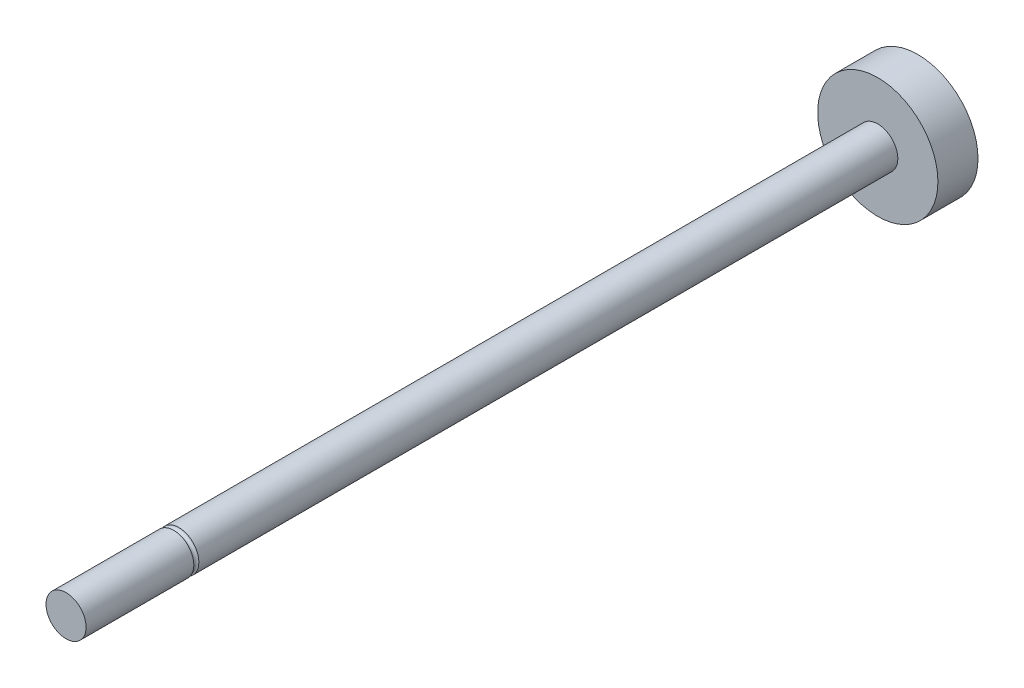
ISO-10303-21;
HEADER;
FILE_DESCRIPTION(('STEP AP214'),'2;1');
FILE_NAME('part.step','',(''),(''),'','','');
FILE_SCHEMA(('AUTOMOTIVE_DESIGN { 1 0 10303 214 1 1 1 1 }'));
ENDSEC;
DATA;
#1=APPLICATION_CONTEXT('core data for automotive mechanical design processes');
#2=APPLICATION_PROTOCOL_DEFINITION('international standard','automotive_design',2000,#1);
#3=PRODUCT_CONTEXT('',#1,'mechanical');
#4=PRODUCT('Part','Part','',(#3));
#5=PRODUCT_RELATED_PRODUCT_CATEGORY('part','',(#4));
#6=PRODUCT_DEFINITION_FORMATION('','',#4);
#7=PRODUCT_DEFINITION_CONTEXT('part definition',#1,'design');
#8=PRODUCT_DEFINITION('design','',#6,#7);
#9=PRODUCT_DEFINITION_SHAPE('','',#8);
#10=(LENGTH_UNIT() NAMED_UNIT(*) SI_UNIT(.MILLI.,.METRE.));
#11=(NAMED_UNIT(*) PLANE_ANGLE_UNIT() SI_UNIT($,.RADIAN.));
#12=(NAMED_UNIT(*) SI_UNIT($,.STERADIAN.) SOLID_ANGLE_UNIT());
#13=UNCERTAINTY_MEASURE_WITH_UNIT(LENGTH_MEASURE(1.E-05),#10,'distance_accuracy_value','');
#14=(GEOMETRIC_REPRESENTATION_CONTEXT(3) GLOBAL_UNCERTAINTY_ASSIGNED_CONTEXT((#13)) GLOBAL_UNIT_ASSIGNED_CONTEXT((#10,
#11,#12)) REPRESENTATION_CONTEXT('',''));
#15=CARTESIAN_POINT('',(0.,0.,0.));
#16=DIRECTION('',(0.,0.,1.));
#17=DIRECTION('',(1.,0.,0.));
#18=AXIS2_PLACEMENT_3D('',#15,#16,#17);
#19=CARTESIAN_POINT('',(0.,0.,85.));
#20=DIRECTION('',(0.,0.,-1.));
#21=DIRECTION('',(-1.,0.,0.));
#22=AXIS2_PLACEMENT_3D('',#19,#20,#21);
#23=CYLINDRICAL_SURFACE('',#22,2.);
#24=CARTESIAN_POINT('',(0.,0.,73.75));
#25=DIRECTION('',(0.,0.,1.));
#26=DIRECTION('',(1.,0.,0.));
#27=AXIS2_PLACEMENT_3D('',#24,#25,#26);
#28=CIRCLE('',#27,2.);
#29=CARTESIAN_POINT('',(2.,0.,73.75));
#30=VERTEX_POINT('',#29);
#31=EDGE_CURVE('E39',#30,#30,#28,.F.);
#32=ORIENTED_EDGE('',*,*,#31,.T.);
#33=EDGE_LOOP('',(#32));
#34=FACE_BOUND('',#33,.T.);
#35=CARTESIAN_POINT('',(0.,0.,4.));
#36=DIRECTION('',(0.,0.,1.));
#37=DIRECTION('',(1.,0.,0.));
#38=AXIS2_PLACEMENT_3D('',#35,#36,#37);
#39=CIRCLE('',#38,2.);
#40=CARTESIAN_POINT('',(2.,0.,4.));
#41=VERTEX_POINT('',#40);
#42=EDGE_CURVE('E48',#41,#41,#39,.F.);
#43=ORIENTED_EDGE('',*,*,#42,.F.);
#44=EDGE_LOOP('',(#43));
#45=FACE_BOUND('',#44,.T.);
#46=ADVANCED_FACE('F35',(#34,#45),#23,.T.);
#47=CARTESIAN_POINT('',(0.,0.,4.));
#48=DIRECTION('',(0.,0.,-1.));
#49=DIRECTION('',(-1.,0.,0.));
#50=AXIS2_PLACEMENT_3D('',#47,#48,#49);
#51=CYLINDRICAL_SURFACE('',#50,6.);
#52=CARTESIAN_POINT('',(0.,0.,4.));
#53=DIRECTION('',(0.,0.,1.));
#54=DIRECTION('',(1.,0.,0.));
#55=AXIS2_PLACEMENT_3D('',#52,#53,#54);
#56=CIRCLE('',#55,6.);
#57=CARTESIAN_POINT('',(6.,0.,4.));
#58=VERTEX_POINT('',#57);
#59=EDGE_CURVE('E10',#58,#58,#56,.T.);
#60=ORIENTED_EDGE('',*,*,#59,.F.);
#61=EDGE_LOOP('',(#60));
#62=FACE_BOUND('',#61,.T.);
#63=CARTESIAN_POINT('',(0.,0.,0.));
#64=DIRECTION('',(0.,0.,1.));
#65=DIRECTION('',(1.,0.,0.));
#66=AXIS2_PLACEMENT_3D('',#63,#64,#65);
#67=CIRCLE('',#66,6.);
#68=CARTESIAN_POINT('',(6.,0.,0.));
#69=VERTEX_POINT('',#68);
#70=EDGE_CURVE('E43',#69,#69,#67,.T.);
#71=ORIENTED_EDGE('',*,*,#70,.T.);
#72=EDGE_LOOP('',(#71));
#73=FACE_BOUND('',#72,.T.);
#74=ADVANCED_FACE('F37',(#62,#73),#51,.T.);
#75=CARTESIAN_POINT('',(0.,0.,4.));
#76=DIRECTION('',(0.,0.,1.));
#77=DIRECTION('',(1.,0.,0.));
#78=AXIS2_PLACEMENT_3D('',#75,#76,#77);
#79=PLANE('',#78);
#80=ORIENTED_EDGE('',*,*,#42,.T.);
#81=EDGE_LOOP('',(#80));
#82=FACE_BOUND('',#81,.T.);
#83=ORIENTED_EDGE('',*,*,#59,.T.);
#84=EDGE_LOOP('',(#83));
#85=FACE_BOUND('',#84,.T.);
#86=ADVANCED_FACE('F66',(#82,#85),#79,.T.);
#87=CARTESIAN_POINT('',(0.,0.,0.));
#88=DIRECTION('',(0.,0.,1.));
#89=DIRECTION('',(1.,0.,0.));
#90=AXIS2_PLACEMENT_3D('',#87,#88,#89);
#91=PLANE('',#90);
#92=ORIENTED_EDGE('',*,*,#70,.F.);
#93=EDGE_LOOP('',(#92));
#94=FACE_BOUND('',#93,.T.);
#95=ADVANCED_FACE('F87',(#94),#91,.F.);
#96=CARTESIAN_POINT('',(0.,0.,74.));
#97=DIRECTION('',(0.,0.,-1.));
#98=DIRECTION('',(-1.,0.,0.));
#99=AXIS2_PLACEMENT_3D('',#96,#97,#98);
#100=TOROIDAL_SURFACE('',#99,2.,0.25);
#101=CARTESIAN_POINT('',(0.,0.,74.25));
#102=DIRECTION('',(0.,0.,-1.));
#103=DIRECTION('',(-1.,0.,0.));
#104=AXIS2_PLACEMENT_3D('',#101,#102,#103);
#105=CIRCLE('',#104,2.);
#106=CARTESIAN_POINT('',(-2.,0.,74.25));
#107=VERTEX_POINT('',#106);
#108=EDGE_CURVE('E52',#107,#107,#105,.F.);
#109=ORIENTED_EDGE('',*,*,#108,.F.);
#110=EDGE_LOOP('',(#109));
#111=FACE_BOUND('',#110,.T.);
#112=ORIENTED_EDGE('',*,*,#31,.F.);
#113=EDGE_LOOP('',(#112));
#114=FACE_BOUND('',#113,.T.);
#115=ADVANCED_FACE('F82',(#111,#114),#100,.F.);
#116=CARTESIAN_POINT('',(0.,0.,85.));
#117=DIRECTION('',(0.,0.,1.));
#118=DIRECTION('',(1.,0.,0.));
#119=AXIS2_PLACEMENT_3D('',#116,#117,#118);
#120=PLANE('',#119);
#121=CARTESIAN_POINT('',(0.,0.,85.));
#122=DIRECTION('',(0.,0.,1.));
#123=DIRECTION('',(1.,0.,0.));
#124=AXIS2_PLACEMENT_3D('',#121,#122,#123);
#125=CIRCLE('',#124,2.);
#126=CARTESIAN_POINT('',(2.,0.,85.));
#127=VERTEX_POINT('',#126);
#128=EDGE_CURVE('E57',#127,#127,#125,.T.);
#129=ORIENTED_EDGE('',*,*,#128,.T.);
#130=EDGE_LOOP('',(#129));
#131=FACE_BOUND('',#130,.T.);
#132=ADVANCED_FACE('F78',(#131),#120,.T.);
#133=ORIENTED_EDGE('',*,*,#108,.T.);
#134=EDGE_LOOP('',(#133));
#135=FACE_BOUND('',#134,.T.);
#136=ORIENTED_EDGE('',*,*,#128,.F.);
#137=EDGE_LOOP('',(#136));
#138=FACE_BOUND('',#137,.T.);
#139=ADVANCED_FACE('F70',(#135,#138),#23,.T.);
#140=CLOSED_SHELL('',(#46,#74,#86,#95,#115,#132,#139));
#141=MANIFOLD_SOLID_BREP('B2',#140);
#142=ADVANCED_BREP_SHAPE_REPRESENTATION('',(#18,#141),#14);
#143=SHAPE_DEFINITION_REPRESENTATION(#9,#142);
ENDSEC;
END-ISO-10303-21;
